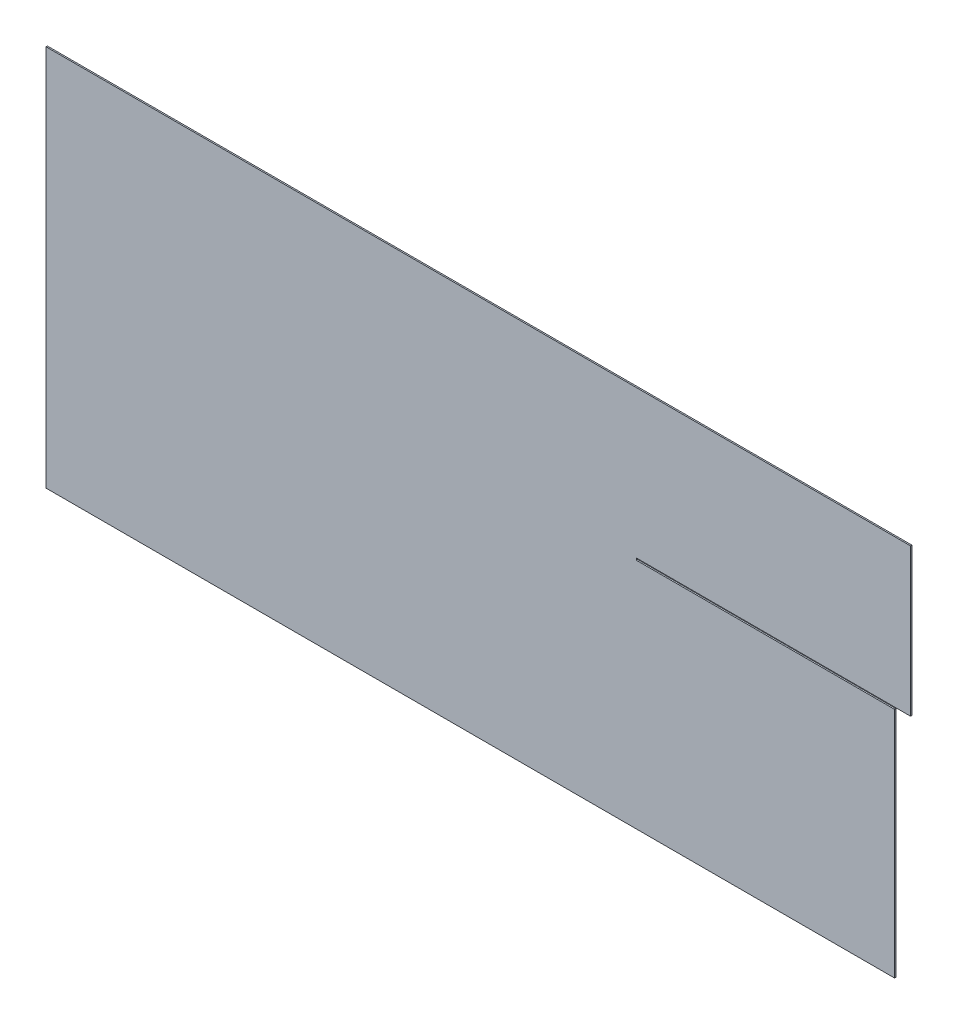
ISO-10303-21;
HEADER;
FILE_DESCRIPTION(('STEP AP214'),'2;1');
FILE_NAME('part.step','',(''),(''),'','','');
FILE_SCHEMA(('AUTOMOTIVE_DESIGN { 1 0 10303 214 1 1 1 1 }'));
ENDSEC;
DATA;
#1=APPLICATION_CONTEXT('core data for automotive mechanical design processes');
#2=APPLICATION_PROTOCOL_DEFINITION('international standard','automotive_design',2000,#1);
#3=PRODUCT_CONTEXT('',#1,'mechanical');
#4=PRODUCT('Part','Part','',(#3));
#5=PRODUCT_RELATED_PRODUCT_CATEGORY('part','',(#4));
#6=PRODUCT_DEFINITION_FORMATION('','',#4);
#7=PRODUCT_DEFINITION_CONTEXT('part definition',#1,'design');
#8=PRODUCT_DEFINITION('design','',#6,#7);
#9=PRODUCT_DEFINITION_SHAPE('','',#8);
#10=(LENGTH_UNIT() NAMED_UNIT(*) SI_UNIT(.MILLI.,.METRE.));
#11=(NAMED_UNIT(*) PLANE_ANGLE_UNIT() SI_UNIT($,.RADIAN.));
#12=(NAMED_UNIT(*) SI_UNIT($,.STERADIAN.) SOLID_ANGLE_UNIT());
#13=UNCERTAINTY_MEASURE_WITH_UNIT(LENGTH_MEASURE(1.E-05),#10,'distance_accuracy_value','');
#14=(GEOMETRIC_REPRESENTATION_CONTEXT(3) GLOBAL_UNCERTAINTY_ASSIGNED_CONTEXT((#13)) GLOBAL_UNIT_ASSIGNED_CONTEXT((#10,
#11,#12)) REPRESENTATION_CONTEXT('',''));
#15=CARTESIAN_POINT('',(0.,0.,0.));
#16=DIRECTION('',(0.,0.,1.));
#17=DIRECTION('',(1.,0.,0.));
#18=AXIS2_PLACEMENT_3D('',#15,#16,#17);
#19=CARTESIAN_POINT('',(1265.,0.,-2.));
#20=DIRECTION('',(0.,-1.,0.));
#21=DIRECTION('',(1.,0.,0.));
#22=AXIS2_PLACEMENT_3D('',#19,#20,#21);
#23=PLANE('',#22);
#24=DIRECTION('',(1.,0.,0.));
#25=VECTOR('',#24,1.);
#26=CARTESIAN_POINT('',(1265.,0.,0.));
#27=LINE('',#26,#25);
#28=CARTESIAN_POINT('',(0.,0.,0.));
#29=VERTEX_POINT('',#28);
#30=CARTESIAN_POINT('',(1265.,0.,0.));
#31=VERTEX_POINT('',#30);
#32=EDGE_CURVE('E135',#29,#31,#27,.T.);
#33=ORIENTED_EDGE('',*,*,#32,.F.);
#34=DIRECTION('',(0.,0.,1.));
#35=VECTOR('',#34,1.);
#36=CARTESIAN_POINT('',(0.,0.,-2.));
#37=LINE('',#36,#35);
#38=CARTESIAN_POINT('',(0.,0.,-2.));
#39=VERTEX_POINT('',#38);
#40=EDGE_CURVE('E11',#39,#29,#37,.T.);
#41=ORIENTED_EDGE('',*,*,#40,.F.);
#42=DIRECTION('',(1.,0.,0.));
#43=VECTOR('',#42,1.);
#44=CARTESIAN_POINT('',(1265.,0.,-2.));
#45=LINE('',#44,#43);
#46=CARTESIAN_POINT('',(1265.,0.,-2.));
#47=VERTEX_POINT('',#46);
#48=EDGE_CURVE('E155',#39,#47,#45,.T.);
#49=ORIENTED_EDGE('',*,*,#48,.T.);
#50=DIRECTION('',(0.,0.,1.));
#51=VECTOR('',#50,1.);
#52=CARTESIAN_POINT('',(1265.,0.,-2.));
#53=LINE('',#52,#51);
#54=EDGE_CURVE('E41',#47,#31,#53,.T.);
#55=ORIENTED_EDGE('',*,*,#54,.T.);
#56=EDGE_LOOP('',(#33,#41,#49,#55));
#57=FACE_BOUND('',#56,.T.);
#58=ADVANCED_FACE('F38',(#57),#23,.T.);
#59=CARTESIAN_POINT('',(0.,0.,-2.));
#60=DIRECTION('',(-1.,0.,0.));
#61=DIRECTION('',(0.,0.,1.));
#62=AXIS2_PLACEMENT_3D('',#59,#60,#61);
#63=PLANE('',#62);
#64=DIRECTION('',(0.,-1.,0.));
#65=VECTOR('',#64,1.);
#66=CARTESIAN_POINT('',(0.,0.,0.));
#67=LINE('',#66,#65);
#68=CARTESIAN_POINT('',(0.,570.,0.));
#69=VERTEX_POINT('',#68);
#70=EDGE_CURVE('E153',#69,#29,#67,.T.);
#71=ORIENTED_EDGE('',*,*,#70,.F.);
#72=DIRECTION('',(0.,0.,1.));
#73=VECTOR('',#72,1.);
#74=CARTESIAN_POINT('',(0.,570.,-2.));
#75=LINE('',#74,#73);
#76=CARTESIAN_POINT('',(0.,570.,-2.));
#77=VERTEX_POINT('',#76);
#78=EDGE_CURVE('E47',#77,#69,#75,.T.);
#79=ORIENTED_EDGE('',*,*,#78,.F.);
#80=DIRECTION('',(0.,-1.,0.));
#81=VECTOR('',#80,1.);
#82=CARTESIAN_POINT('',(0.,0.,-2.));
#83=LINE('',#82,#81);
#84=EDGE_CURVE('E125',#77,#39,#83,.T.);
#85=ORIENTED_EDGE('',*,*,#84,.T.);
#86=ORIENTED_EDGE('',*,*,#40,.T.);
#87=EDGE_LOOP('',(#71,#79,#85,#86));
#88=FACE_BOUND('',#87,.T.);
#89=ADVANCED_FACE('F167',(#88),#63,.T.);
#90=CARTESIAN_POINT('',(0.,570.,-2.));
#91=DIRECTION('',(0.,1.,0.));
#92=DIRECTION('',(0.,0.,1.));
#93=AXIS2_PLACEMENT_3D('',#90,#91,#92);
#94=PLANE('',#93);
#95=DIRECTION('',(-1.,0.,0.));
#96=VECTOR('',#95,1.);
#97=CARTESIAN_POINT('',(0.,570.,0.));
#98=LINE('',#97,#96);
#99=CARTESIAN_POINT('',(1289.,570.,0.));
#100=VERTEX_POINT('',#99);
#101=EDGE_CURVE('E112',#100,#69,#98,.T.);
#102=ORIENTED_EDGE('',*,*,#101,.F.);
#103=DIRECTION('',(0.,0.,1.));
#104=VECTOR('',#103,1.);
#105=CARTESIAN_POINT('',(1289.,570.,-2.));
#106=LINE('',#105,#104);
#107=CARTESIAN_POINT('',(1289.,570.,-2.));
#108=VERTEX_POINT('',#107);
#109=EDGE_CURVE('E107',#108,#100,#106,.T.);
#110=ORIENTED_EDGE('',*,*,#109,.F.);
#111=DIRECTION('',(-1.,0.,0.));
#112=VECTOR('',#111,1.);
#113=CARTESIAN_POINT('',(0.,570.,-2.));
#114=LINE('',#113,#112);
#115=EDGE_CURVE('E110',#108,#77,#114,.T.);
#116=ORIENTED_EDGE('',*,*,#115,.T.);
#117=ORIENTED_EDGE('',*,*,#78,.T.);
#118=EDGE_LOOP('',(#102,#110,#116,#117));
#119=FACE_BOUND('',#118,.T.);
#120=ADVANCED_FACE('F109',(#119),#94,.T.);
#121=CARTESIAN_POINT('',(1289.,570.,-2.));
#122=DIRECTION('',(1.,0.,0.));
#123=DIRECTION('',(0.,0.,-1.));
#124=AXIS2_PLACEMENT_3D('',#121,#122,#123);
#125=PLANE('',#124);
#126=DIRECTION('',(0.,1.,0.));
#127=VECTOR('',#126,1.);
#128=CARTESIAN_POINT('',(1289.,570.,0.));
#129=LINE('',#128,#127);
#130=CARTESIAN_POINT('',(1289.,350.,0.));
#131=VERTEX_POINT('',#130);
#132=EDGE_CURVE('E150',#131,#100,#129,.T.);
#133=ORIENTED_EDGE('',*,*,#132,.F.);
#134=DIRECTION('',(0.,0.,1.));
#135=VECTOR('',#134,1.);
#136=CARTESIAN_POINT('',(1289.,350.,-2.));
#137=LINE('',#136,#135);
#138=CARTESIAN_POINT('',(1289.,350.,-2.));
#139=VERTEX_POINT('',#138);
#140=EDGE_CURVE('E117',#139,#131,#137,.T.);
#141=ORIENTED_EDGE('',*,*,#140,.F.);
#142=DIRECTION('',(0.,1.,0.));
#143=VECTOR('',#142,1.);
#144=CARTESIAN_POINT('',(1289.,570.,-2.));
#145=LINE('',#144,#143);
#146=EDGE_CURVE('E123',#139,#108,#145,.T.);
#147=ORIENTED_EDGE('',*,*,#146,.T.);
#148=ORIENTED_EDGE('',*,*,#109,.T.);
#149=EDGE_LOOP('',(#133,#141,#147,#148));
#150=FACE_BOUND('',#149,.T.);
#151=ADVANCED_FACE('F127',(#150),#125,.T.);
#152=CARTESIAN_POINT('',(1289.,350.,-2.));
#153=DIRECTION('',(0.,-1.,0.));
#154=DIRECTION('',(1.,0.,0.));
#155=AXIS2_PLACEMENT_3D('',#152,#153,#154);
#156=PLANE('',#155);
#157=DIRECTION('',(1.,0.,0.));
#158=VECTOR('',#157,1.);
#159=CARTESIAN_POINT('',(1289.,350.,0.));
#160=LINE('',#159,#158);
#161=CARTESIAN_POINT('',(880.,350.,0.));
#162=VERTEX_POINT('',#161);
#163=EDGE_CURVE('E147',#162,#131,#160,.T.);
#164=ORIENTED_EDGE('',*,*,#163,.F.);
#165=DIRECTION('',(0.,0.,1.));
#166=VECTOR('',#165,1.);
#167=CARTESIAN_POINT('',(880.,350.,-2.));
#168=LINE('',#167,#166);
#169=CARTESIAN_POINT('',(880.,350.,-2.));
#170=VERTEX_POINT('',#169);
#171=EDGE_CURVE('E159',#170,#162,#168,.T.);
#172=ORIENTED_EDGE('',*,*,#171,.F.);
#173=DIRECTION('',(1.,0.,0.));
#174=VECTOR('',#173,1.);
#175=CARTESIAN_POINT('',(1289.,350.,-2.));
#176=LINE('',#175,#174);
#177=EDGE_CURVE('E128',#170,#139,#176,.T.);
#178=ORIENTED_EDGE('',*,*,#177,.T.);
#179=ORIENTED_EDGE('',*,*,#140,.T.);
#180=EDGE_LOOP('',(#164,#172,#178,#179));
#181=FACE_BOUND('',#180,.T.);
#182=ADVANCED_FACE('F180',(#181),#156,.T.);
#183=CARTESIAN_POINT('',(880.,350.,-2.));
#184=DIRECTION('',(1.,0.,0.));
#185=DIRECTION('',(0.,0.,-1.));
#186=AXIS2_PLACEMENT_3D('',#183,#184,#185);
#187=PLANE('',#186);
#188=DIRECTION('',(0.,1.,0.));
#189=VECTOR('',#188,1.);
#190=CARTESIAN_POINT('',(880.,350.,0.));
#191=LINE('',#190,#189);
#192=CARTESIAN_POINT('',(880.,347.,0.));
#193=VERTEX_POINT('',#192);
#194=EDGE_CURVE('E144',#193,#162,#191,.T.);
#195=ORIENTED_EDGE('',*,*,#194,.F.);
#196=DIRECTION('',(0.,0.,1.));
#197=VECTOR('',#196,1.);
#198=CARTESIAN_POINT('',(880.,347.,-2.));
#199=LINE('',#198,#197);
#200=CARTESIAN_POINT('',(880.,347.,-2.));
#201=VERTEX_POINT('',#200);
#202=EDGE_CURVE('E161',#201,#193,#199,.T.);
#203=ORIENTED_EDGE('',*,*,#202,.F.);
#204=DIRECTION('',(0.,1.,0.));
#205=VECTOR('',#204,1.);
#206=CARTESIAN_POINT('',(880.,350.,-2.));
#207=LINE('',#206,#205);
#208=EDGE_CURVE('E130',#201,#170,#207,.T.);
#209=ORIENTED_EDGE('',*,*,#208,.T.);
#210=ORIENTED_EDGE('',*,*,#171,.T.);
#211=EDGE_LOOP('',(#195,#203,#209,#210));
#212=FACE_BOUND('',#211,.T.);
#213=ADVANCED_FACE('F183',(#212),#187,.T.);
#214=CARTESIAN_POINT('',(880.,347.,-2.));
#215=DIRECTION('',(0.,1.,0.));
#216=DIRECTION('',(0.,0.,1.));
#217=AXIS2_PLACEMENT_3D('',#214,#215,#216);
#218=PLANE('',#217);
#219=DIRECTION('',(-1.,0.,0.));
#220=VECTOR('',#219,1.);
#221=CARTESIAN_POINT('',(880.,347.,0.));
#222=LINE('',#221,#220);
#223=CARTESIAN_POINT('',(1265.,347.,0.));
#224=VERTEX_POINT('',#223);
#225=EDGE_CURVE('E141',#224,#193,#222,.T.);
#226=ORIENTED_EDGE('',*,*,#225,.F.);
#227=DIRECTION('',(0.,0.,1.));
#228=VECTOR('',#227,1.);
#229=CARTESIAN_POINT('',(1265.,347.,-2.));
#230=LINE('',#229,#228);
#231=CARTESIAN_POINT('',(1265.,347.,-2.));
#232=VERTEX_POINT('',#231);
#233=EDGE_CURVE('E162',#232,#224,#230,.T.);
#234=ORIENTED_EDGE('',*,*,#233,.F.);
#235=DIRECTION('',(-1.,0.,0.));
#236=VECTOR('',#235,1.);
#237=CARTESIAN_POINT('',(880.,347.,-2.));
#238=LINE('',#237,#236);
#239=EDGE_CURVE('E278',#232,#201,#238,.T.);
#240=ORIENTED_EDGE('',*,*,#239,.T.);
#241=ORIENTED_EDGE('',*,*,#202,.T.);
#242=EDGE_LOOP('',(#226,#234,#240,#241));
#243=FACE_BOUND('',#242,.T.);
#244=ADVANCED_FACE('F187',(#243),#218,.T.);
#245=CARTESIAN_POINT('',(1265.,347.,-2.));
#246=DIRECTION('',(1.,0.,0.));
#247=DIRECTION('',(0.,0.,-1.));
#248=AXIS2_PLACEMENT_3D('',#245,#246,#247);
#249=PLANE('',#248);
#250=DIRECTION('',(0.,1.,0.));
#251=VECTOR('',#250,1.);
#252=CARTESIAN_POINT('',(1265.,347.,0.));
#253=LINE('',#252,#251);
#254=EDGE_CURVE('E138',#31,#224,#253,.T.);
#255=ORIENTED_EDGE('',*,*,#254,.F.);
#256=ORIENTED_EDGE('',*,*,#54,.F.);
#257=DIRECTION('',(0.,1.,0.));
#258=VECTOR('',#257,1.);
#259=CARTESIAN_POINT('',(1265.,347.,-2.));
#260=LINE('',#259,#258);
#261=EDGE_CURVE('E279',#47,#232,#260,.T.);
#262=ORIENTED_EDGE('',*,*,#261,.T.);
#263=ORIENTED_EDGE('',*,*,#233,.T.);
#264=EDGE_LOOP('',(#255,#256,#262,#263));
#265=FACE_BOUND('',#264,.T.);
#266=ADVANCED_FACE('F164',(#265),#249,.T.);
#267=CARTESIAN_POINT('',(0.,0.,-2.));
#268=DIRECTION('',(0.,0.,-1.));
#269=DIRECTION('',(-1.,0.,0.));
#270=AXIS2_PLACEMENT_3D('',#267,#268,#269);
#271=PLANE('',#270);
#272=ORIENTED_EDGE('',*,*,#48,.F.);
#273=ORIENTED_EDGE('',*,*,#84,.F.);
#274=ORIENTED_EDGE('',*,*,#115,.F.);
#275=ORIENTED_EDGE('',*,*,#146,.F.);
#276=ORIENTED_EDGE('',*,*,#177,.F.);
#277=ORIENTED_EDGE('',*,*,#208,.F.);
#278=ORIENTED_EDGE('',*,*,#239,.F.);
#279=ORIENTED_EDGE('',*,*,#261,.F.);
#280=EDGE_LOOP('',(#272,#273,#274,#275,#276,#277,#278,#279));
#281=FACE_BOUND('',#280,.T.);
#282=ADVANCED_FACE('F121',(#281),#271,.T.);
#283=CARTESIAN_POINT('',(0.,0.,0.));
#284=DIRECTION('',(0.,0.,-1.));
#285=DIRECTION('',(-1.,0.,0.));
#286=AXIS2_PLACEMENT_3D('',#283,#284,#285);
#287=PLANE('',#286);
#288=ORIENTED_EDGE('',*,*,#32,.T.);
#289=ORIENTED_EDGE('',*,*,#254,.T.);
#290=ORIENTED_EDGE('',*,*,#225,.T.);
#291=ORIENTED_EDGE('',*,*,#194,.T.);
#292=ORIENTED_EDGE('',*,*,#163,.T.);
#293=ORIENTED_EDGE('',*,*,#132,.T.);
#294=ORIENTED_EDGE('',*,*,#101,.T.);
#295=ORIENTED_EDGE('',*,*,#70,.T.);
#296=EDGE_LOOP('',(#288,#289,#290,#291,#292,#293,#294,#295));
#297=FACE_BOUND('',#296,.T.);
#298=ADVANCED_FACE('F166',(#297),#287,.F.);
#299=CLOSED_SHELL('',(#58,#89,#120,#151,#182,#213,#244,#266,#282,#298));
#300=MANIFOLD_SOLID_BREP('B2',#299);
#301=ADVANCED_BREP_SHAPE_REPRESENTATION('',(#18,#300),#14);
#302=SHAPE_DEFINITION_REPRESENTATION(#9,#301);
ENDSEC;
END-ISO-10303-21;
